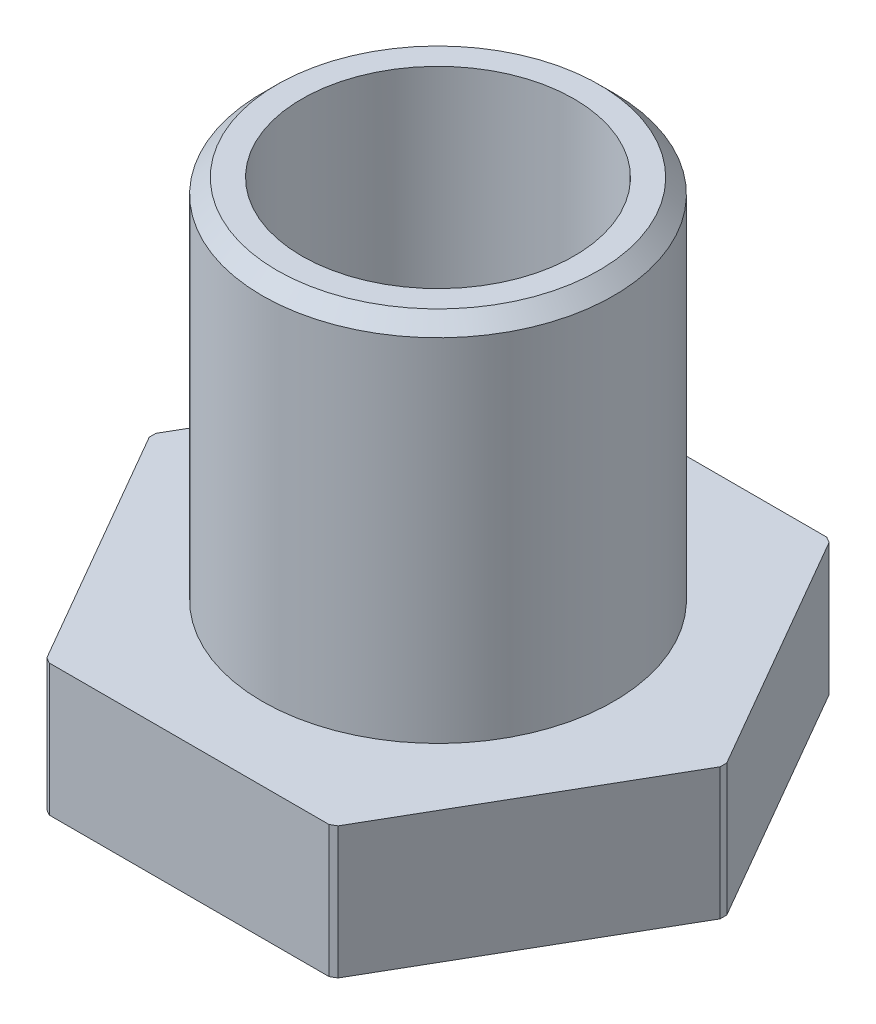
ISO-10303-21;
HEADER;
FILE_DESCRIPTION(('STEP AP214'),'2;1');
FILE_NAME('part.step','',(''),(''),'','','');
FILE_SCHEMA(('AUTOMOTIVE_DESIGN { 1 0 10303 214 1 1 1 1 }'));
ENDSEC;
DATA;
#1=APPLICATION_CONTEXT('core data for automotive mechanical design processes');
#2=APPLICATION_PROTOCOL_DEFINITION('international standard','automotive_design',2000,#1);
#3=PRODUCT_CONTEXT('',#1,'mechanical');
#4=PRODUCT('Part','Part','',(#3));
#5=PRODUCT_RELATED_PRODUCT_CATEGORY('part','',(#4));
#6=PRODUCT_DEFINITION_FORMATION('','',#4);
#7=PRODUCT_DEFINITION_CONTEXT('part definition',#1,'design');
#8=PRODUCT_DEFINITION('design','',#6,#7);
#9=PRODUCT_DEFINITION_SHAPE('','',#8);
#10=(LENGTH_UNIT() NAMED_UNIT(*) SI_UNIT(.MILLI.,.METRE.));
#11=(NAMED_UNIT(*) PLANE_ANGLE_UNIT() SI_UNIT($,.RADIAN.));
#12=(NAMED_UNIT(*) SI_UNIT($,.STERADIAN.) SOLID_ANGLE_UNIT());
#13=UNCERTAINTY_MEASURE_WITH_UNIT(LENGTH_MEASURE(1.E-05),#10,'distance_accuracy_value','');
#14=(GEOMETRIC_REPRESENTATION_CONTEXT(3) GLOBAL_UNCERTAINTY_ASSIGNED_CONTEXT((#13)) GLOBAL_UNIT_ASSIGNED_CONTEXT((#10,
#11,#12)) REPRESENTATION_CONTEXT('',''));
#15=CARTESIAN_POINT('',(0.,0.,0.));
#16=DIRECTION('',(0.,0.,1.));
#17=DIRECTION('',(1.,0.,0.));
#18=AXIS2_PLACEMENT_3D('',#15,#16,#17);
#19=CARTESIAN_POINT('',(9.81495457622364,0.,0.));
#20=DIRECTION('',(0.,1.,0.));
#21=DIRECTION('',(0.,0.,1.));
#22=AXIS2_PLACEMENT_3D('',#19,#20,#21);
#23=PLANE('',#22);
#24=CARTESIAN_POINT('',(0.,0.,0.));
#25=DIRECTION('',(0.,-1.,0.));
#26=DIRECTION('',(0.,0.,-1.));
#27=AXIS2_PLACEMENT_3D('',#24,#25,#26);
#28=CIRCLE('',#27,6.75);
#29=CARTESIAN_POINT('',(0.,0.,-6.75));
#30=VERTEX_POINT('',#29);
#31=EDGE_CURVE('E244',#30,#30,#28,.T.);
#32=ORIENTED_EDGE('',*,*,#31,.F.);
#33=EDGE_LOOP('',(#32));
#34=FACE_BOUND('',#33,.T.);
#35=CARTESIAN_POINT('',(0.,0.,0.));
#36=DIRECTION('',(0.,-1.,0.));
#37=DIRECTION('',(0.,0.,-1.));
#38=AXIS2_PLACEMENT_3D('',#35,#36,#37);
#39=CIRCLE('',#38,9.75);
#40=CARTESIAN_POINT('',(-4.97309428534989,0.,-8.38634802694357));
#41=VERTEX_POINT('',#40);
#42=CARTESIAN_POINT('',(-4.77624329363569,0.,-8.5));
#43=VERTEX_POINT('',#42);
#44=EDGE_CURVE('E59',#41,#43,#39,.T.);
#45=ORIENTED_EDGE('',*,*,#44,.T.);
#46=DIRECTION('',(-1.,0.,0.));
#47=VECTOR('',#46,1.);
#48=CARTESIAN_POINT('',(4.90747728811182,0.,-8.5));
#49=LINE('',#48,#47);
#50=CARTESIAN_POINT('',(4.77624329363569,0.,-8.5));
#51=VERTEX_POINT('',#50);
#52=EDGE_CURVE('E143',#51,#43,#49,.T.);
#53=ORIENTED_EDGE('',*,*,#52,.F.);
#54=CARTESIAN_POINT('',(0.,0.,0.));
#55=DIRECTION('',(0.,-1.,0.));
#56=DIRECTION('',(0.,0.,-1.));
#57=AXIS2_PLACEMENT_3D('',#54,#55,#56);
#58=CIRCLE('',#57,9.75);
#59=CARTESIAN_POINT('',(4.97309428534988,0.,-8.38634802694357));
#60=VERTEX_POINT('',#59);
#61=EDGE_CURVE('E67',#51,#60,#58,.T.);
#62=ORIENTED_EDGE('',*,*,#61,.T.);
#63=DIRECTION('',(-0.5,0.,-0.866025403784439));
#64=VECTOR('',#63,1.);
#65=CARTESIAN_POINT('',(9.81495457622364,0.,0.));
#66=LINE('',#65,#64);
#67=CARTESIAN_POINT('',(9.74933757898557,0.,-0.113651973056435));
#68=VERTEX_POINT('',#67);
#69=EDGE_CURVE('E148',#68,#60,#66,.T.);
#70=ORIENTED_EDGE('',*,*,#69,.F.);
#71=CARTESIAN_POINT('',(0.,0.,0.));
#72=DIRECTION('',(0.,-1.,0.));
#73=DIRECTION('',(0.,0.,-1.));
#74=AXIS2_PLACEMENT_3D('',#71,#72,#73);
#75=CIRCLE('',#74,9.75);
#76=CARTESIAN_POINT('',(9.74933757898558,0.,0.113651973056438));
#77=VERTEX_POINT('',#76);
#78=EDGE_CURVE('E187',#68,#77,#75,.T.);
#79=ORIENTED_EDGE('',*,*,#78,.T.);
#80=DIRECTION('',(0.5,0.,-0.866025403784439));
#81=VECTOR('',#80,1.);
#82=CARTESIAN_POINT('',(4.90747728811182,0.,8.50000000000001));
#83=LINE('',#82,#81);
#84=CARTESIAN_POINT('',(4.97309428534989,0.,8.38634802694356));
#85=VERTEX_POINT('',#84);
#86=EDGE_CURVE('E153',#85,#77,#83,.T.);
#87=ORIENTED_EDGE('',*,*,#86,.F.);
#88=CARTESIAN_POINT('',(0.,0.,0.));
#89=DIRECTION('',(0.,-1.,0.));
#90=DIRECTION('',(0.,0.,-1.));
#91=AXIS2_PLACEMENT_3D('',#88,#89,#90);
#92=CIRCLE('',#91,9.75);
#93=CARTESIAN_POINT('',(4.77624329363569,0.,8.5));
#94=VERTEX_POINT('',#93);
#95=EDGE_CURVE('E214',#85,#94,#92,.T.);
#96=ORIENTED_EDGE('',*,*,#95,.T.);
#97=DIRECTION('',(1.,0.,0.));
#98=VECTOR('',#97,1.);
#99=CARTESIAN_POINT('',(-4.90747728811182,0.,8.50000000000001));
#100=LINE('',#99,#98);
#101=CARTESIAN_POINT('',(-4.77624329363569,0.,8.50000000000001));
#102=VERTEX_POINT('',#101);
#103=EDGE_CURVE('E159',#102,#94,#100,.T.);
#104=ORIENTED_EDGE('',*,*,#103,.F.);
#105=CARTESIAN_POINT('',(0.,0.,0.));
#106=DIRECTION('',(0.,-1.,0.));
#107=DIRECTION('',(0.,0.,-1.));
#108=AXIS2_PLACEMENT_3D('',#105,#106,#107);
#109=CIRCLE('',#108,9.75);
#110=CARTESIAN_POINT('',(-4.97309428534988,0.,8.38634802694357));
#111=VERTEX_POINT('',#110);
#112=EDGE_CURVE('E230',#102,#111,#109,.T.);
#113=ORIENTED_EDGE('',*,*,#112,.T.);
#114=DIRECTION('',(0.5,0.,0.866025403784438));
#115=VECTOR('',#114,1.);
#116=CARTESIAN_POINT('',(-9.81495457622364,0.,0.));
#117=LINE('',#116,#115);
#118=CARTESIAN_POINT('',(-9.74933757898558,0.,0.113651973056427));
#119=VERTEX_POINT('',#118);
#120=EDGE_CURVE('E150',#119,#111,#117,.T.);
#121=ORIENTED_EDGE('',*,*,#120,.F.);
#122=CARTESIAN_POINT('',(0.,0.,0.));
#123=DIRECTION('',(0.,-1.,0.));
#124=DIRECTION('',(0.,0.,-1.));
#125=AXIS2_PLACEMENT_3D('',#122,#123,#124);
#126=CIRCLE('',#125,9.75);
#127=CARTESIAN_POINT('',(-9.74933757898558,0.,-0.113651973056427));
#128=VERTEX_POINT('',#127);
#129=EDGE_CURVE('E238',#119,#128,#126,.T.);
#130=ORIENTED_EDGE('',*,*,#129,.T.);
#131=DIRECTION('',(-0.5,0.,0.866025403784439));
#132=VECTOR('',#131,1.);
#133=CARTESIAN_POINT('',(-4.90747728811182,0.,-8.5));
#134=LINE('',#133,#132);
#135=EDGE_CURVE('E145',#41,#128,#134,.T.);
#136=ORIENTED_EDGE('',*,*,#135,.F.);
#137=EDGE_LOOP('',(#45,#53,#62,#70,#79,#87,#96,#104,#113,#121,#130,#136));
#138=FACE_BOUND('',#137,.T.);
#139=ADVANCED_FACE('F45',(#34,#138),#23,.F.);
#140=CARTESIAN_POINT('',(-20.3397298662751,4.5,0.));
#141=DIRECTION('',(0.,1.,0.));
#142=DIRECTION('',(0.,0.,1.));
#143=AXIS2_PLACEMENT_3D('',#140,#141,#142);
#144=PLANE('',#143);
#145=CARTESIAN_POINT('',(0.,4.5,0.));
#146=DIRECTION('',(0.,1.,0.));
#147=DIRECTION('',(0.,0.,1.));
#148=AXIS2_PLACEMENT_3D('',#145,#146,#147);
#149=CIRCLE('',#148,6.);
#150=CARTESIAN_POINT('',(0.,4.5,6.));
#151=VERTEX_POINT('',#150);
#152=EDGE_CURVE('E253',#151,#151,#149,.T.);
#153=ORIENTED_EDGE('',*,*,#152,.F.);
#154=EDGE_LOOP('',(#153));
#155=FACE_BOUND('',#154,.T.);
#156=DIRECTION('',(-1.,0.,0.));
#157=VECTOR('',#156,1.);
#158=CARTESIAN_POINT('',(-20.3397298662751,4.5,-8.5));
#159=LINE('',#158,#157);
#160=CARTESIAN_POINT('',(4.77624329363569,4.5,-8.5));
#161=VERTEX_POINT('',#160);
#162=CARTESIAN_POINT('',(-4.77624329363569,4.5,-8.5));
#163=VERTEX_POINT('',#162);
#164=EDGE_CURVE('E183',#161,#163,#159,.T.);
#165=ORIENTED_EDGE('',*,*,#164,.T.);
#166=CARTESIAN_POINT('',(0.,4.5,0.));
#167=DIRECTION('',(0.,1.,0.));
#168=DIRECTION('',(0.,0.,1.));
#169=AXIS2_PLACEMENT_3D('',#166,#167,#168);
#170=CIRCLE('',#169,9.75);
#171=CARTESIAN_POINT('',(-4.97309428534988,4.5,-8.38634802694357));
#172=VERTEX_POINT('',#171);
#173=EDGE_CURVE('E134',#163,#172,#170,.T.);
#174=ORIENTED_EDGE('',*,*,#173,.T.);
#175=DIRECTION('',(-0.5,0.,0.866025403784439));
#176=VECTOR('',#175,1.);
#177=CARTESIAN_POINT('',(-12.4461483987365,4.5,4.55736138515367));
#178=LINE('',#177,#176);
#179=CARTESIAN_POINT('',(-9.74933757898558,4.5,-0.113651973056427));
#180=VERTEX_POINT('',#179);
#181=EDGE_CURVE('E190',#172,#180,#178,.T.);
#182=ORIENTED_EDGE('',*,*,#181,.T.);
#183=CARTESIAN_POINT('',(0.,4.5,0.));
#184=DIRECTION('',(0.,1.,0.));
#185=DIRECTION('',(0.,0.,1.));
#186=AXIS2_PLACEMENT_3D('',#183,#184,#185);
#187=CIRCLE('',#186,9.75);
#188=CARTESIAN_POINT('',(-9.74933757898558,4.5,0.113651973056426));
#189=VERTEX_POINT('',#188);
#190=EDGE_CURVE('E168',#180,#189,#187,.T.);
#191=ORIENTED_EDGE('',*,*,#190,.T.);
#192=DIRECTION('',(0.5,0.,0.866025403784439));
#193=VECTOR('',#192,1.);
#194=CARTESIAN_POINT('',(-12.4461483987365,4.5,-4.55736138515367));
#195=LINE('',#194,#193);
#196=CARTESIAN_POINT('',(-4.97309428534988,4.5,8.38634802694357));
#197=VERTEX_POINT('',#196);
#198=EDGE_CURVE('E192',#189,#197,#195,.T.);
#199=ORIENTED_EDGE('',*,*,#198,.T.);
#200=CARTESIAN_POINT('',(0.,4.5,0.));
#201=DIRECTION('',(0.,1.,0.));
#202=DIRECTION('',(0.,0.,1.));
#203=AXIS2_PLACEMENT_3D('',#200,#201,#202);
#204=CIRCLE('',#203,9.75);
#205=CARTESIAN_POINT('',(-4.77624329363569,4.5,8.5));
#206=VERTEX_POINT('',#205);
#207=EDGE_CURVE('E235',#197,#206,#204,.T.);
#208=ORIENTED_EDGE('',*,*,#207,.T.);
#209=DIRECTION('',(1.,0.,0.));
#210=VECTOR('',#209,1.);
#211=CARTESIAN_POINT('',(-20.3397298662751,4.5,8.5));
#212=LINE('',#211,#210);
#213=CARTESIAN_POINT('',(4.77624329363569,4.5,8.5));
#214=VERTEX_POINT('',#213);
#215=EDGE_CURVE('E258',#206,#214,#212,.T.);
#216=ORIENTED_EDGE('',*,*,#215,.T.);
#217=CARTESIAN_POINT('',(0.,4.5,0.));
#218=DIRECTION('',(0.,1.,0.));
#219=DIRECTION('',(0.,0.,1.));
#220=AXIS2_PLACEMENT_3D('',#217,#218,#219);
#221=CIRCLE('',#220,9.75);
#222=CARTESIAN_POINT('',(4.9730942853499,4.5,8.38634802694356));
#223=VERTEX_POINT('',#222);
#224=EDGE_CURVE('E227',#214,#223,#221,.T.);
#225=ORIENTED_EDGE('',*,*,#224,.T.);
#226=DIRECTION('',(0.5,0.,-0.866025403784439));
#227=VECTOR('',#226,1.);
#228=CARTESIAN_POINT('',(2.27628346559896,4.5,13.0573613851537));
#229=LINE('',#228,#227);
#230=CARTESIAN_POINT('',(9.74933757898558,4.5,0.113651973056438));
#231=VERTEX_POINT('',#230);
#232=EDGE_CURVE('E194',#223,#231,#229,.T.);
#233=ORIENTED_EDGE('',*,*,#232,.T.);
#234=CARTESIAN_POINT('',(0.,4.5,0.));
#235=DIRECTION('',(0.,1.,0.));
#236=DIRECTION('',(0.,0.,1.));
#237=AXIS2_PLACEMENT_3D('',#234,#235,#236);
#238=CIRCLE('',#237,9.75);
#239=CARTESIAN_POINT('',(9.74933757898558,4.5,-0.113651973056435));
#240=VERTEX_POINT('',#239);
#241=EDGE_CURVE('E219',#231,#240,#238,.T.);
#242=ORIENTED_EDGE('',*,*,#241,.T.);
#243=DIRECTION('',(-0.5,0.,-0.866025403784439));
#244=VECTOR('',#243,1.);
#245=CARTESIAN_POINT('',(2.27628346559894,4.5,-13.0573613851537));
#246=LINE('',#245,#244);
#247=CARTESIAN_POINT('',(4.97309428534988,4.5,-8.38634802694357));
#248=VERTEX_POINT('',#247);
#249=EDGE_CURVE('E186',#240,#248,#246,.T.);
#250=ORIENTED_EDGE('',*,*,#249,.T.);
#251=CARTESIAN_POINT('',(0.,4.5,0.));
#252=DIRECTION('',(0.,1.,0.));
#253=DIRECTION('',(0.,0.,1.));
#254=AXIS2_PLACEMENT_3D('',#251,#252,#253);
#255=CIRCLE('',#254,9.75);
#256=EDGE_CURVE('E178',#248,#161,#255,.T.);
#257=ORIENTED_EDGE('',*,*,#256,.T.);
#258=EDGE_LOOP('',(#165,#174,#182,#191,#199,#208,#216,#225,#233,#242,#250,#257));
#259=FACE_BOUND('',#258,.T.);
#260=ADVANCED_FACE('F182',(#155,#259),#144,.T.);
#261=CARTESIAN_POINT('',(4.90747728811182,17.,-8.5));
#262=DIRECTION('',(0.,0.,1.));
#263=DIRECTION('',(1.,0.,0.));
#264=AXIS2_PLACEMENT_3D('',#261,#262,#263);
#265=PLANE('',#264);
#266=DIRECTION('',(0.,-1.,0.));
#267=VECTOR('',#266,1.);
#268=CARTESIAN_POINT('',(-4.77624329363569,17.,-8.5));
#269=LINE('',#268,#267);
#270=EDGE_CURVE('E131',#163,#43,#269,.T.);
#271=ORIENTED_EDGE('',*,*,#270,.F.);
#272=ORIENTED_EDGE('',*,*,#164,.F.);
#273=DIRECTION('',(0.,-1.,0.));
#274=VECTOR('',#273,1.);
#275=CARTESIAN_POINT('',(4.77624329363569,17.,-8.5));
#276=LINE('',#275,#274);
#277=EDGE_CURVE('E53',#51,#161,#276,.F.);
#278=ORIENTED_EDGE('',*,*,#277,.F.);
#279=ORIENTED_EDGE('',*,*,#52,.T.);
#280=EDGE_LOOP('',(#271,#272,#278,#279));
#281=FACE_BOUND('',#280,.T.);
#282=ADVANCED_FACE('F147',(#281),#265,.F.);
#283=CARTESIAN_POINT('',(-4.90747728811182,17.,-8.5));
#284=DIRECTION('',(0.866025403784439,0.,0.5));
#285=DIRECTION('',(0.5,0.,-0.866025403784439));
#286=AXIS2_PLACEMENT_3D('',#283,#284,#285);
#287=PLANE('',#286);
#288=DIRECTION('',(0.,-1.,0.));
#289=VECTOR('',#288,1.);
#290=CARTESIAN_POINT('',(-4.97309428534989,17.,-8.38634802694357));
#291=LINE('',#290,#289);
#292=EDGE_CURVE('E13',#41,#172,#291,.F.);
#293=ORIENTED_EDGE('',*,*,#292,.F.);
#294=ORIENTED_EDGE('',*,*,#135,.T.);
#295=DIRECTION('',(0.,-1.,0.));
#296=VECTOR('',#295,1.);
#297=CARTESIAN_POINT('',(-9.74933757898558,17.,-0.113651973056427));
#298=LINE('',#297,#296);
#299=EDGE_CURVE('E241',#180,#128,#298,.T.);
#300=ORIENTED_EDGE('',*,*,#299,.F.);
#301=ORIENTED_EDGE('',*,*,#181,.F.);
#302=EDGE_LOOP('',(#293,#294,#300,#301));
#303=FACE_BOUND('',#302,.T.);
#304=ADVANCED_FACE('F279',(#303),#287,.F.);
#305=CARTESIAN_POINT('',(9.81495457622364,17.,0.));
#306=DIRECTION('',(-0.866025403784439,0.,0.5));
#307=DIRECTION('',(0.5,0.,0.866025403784439));
#308=AXIS2_PLACEMENT_3D('',#305,#306,#307);
#309=PLANE('',#308);
#310=DIRECTION('',(0.,-1.,0.));
#311=VECTOR('',#310,1.);
#312=CARTESIAN_POINT('',(4.97309428534988,17.,-8.38634802694357));
#313=LINE('',#312,#311);
#314=EDGE_CURVE('E188',#248,#60,#313,.T.);
#315=ORIENTED_EDGE('',*,*,#314,.F.);
#316=ORIENTED_EDGE('',*,*,#249,.F.);
#317=DIRECTION('',(0.,-1.,0.));
#318=VECTOR('',#317,1.);
#319=CARTESIAN_POINT('',(9.74933757898558,17.,-0.113651973056431));
#320=LINE('',#319,#318);
#321=EDGE_CURVE('E175',#68,#240,#320,.F.);
#322=ORIENTED_EDGE('',*,*,#321,.F.);
#323=ORIENTED_EDGE('',*,*,#69,.T.);
#324=EDGE_LOOP('',(#315,#316,#322,#323));
#325=FACE_BOUND('',#324,.T.);
#326=ADVANCED_FACE('F281',(#325),#309,.F.);
#327=CARTESIAN_POINT('',(4.90747728811182,17.,8.50000000000001));
#328=DIRECTION('',(-0.866025403784439,0.,-0.5));
#329=DIRECTION('',(-0.5,0.,0.866025403784439));
#330=AXIS2_PLACEMENT_3D('',#327,#328,#329);
#331=PLANE('',#330);
#332=DIRECTION('',(0.,-1.,0.));
#333=VECTOR('',#332,1.);
#334=CARTESIAN_POINT('',(9.74933757898558,17.,0.113651973056438));
#335=LINE('',#334,#333);
#336=EDGE_CURVE('E209',#231,#77,#335,.T.);
#337=ORIENTED_EDGE('',*,*,#336,.F.);
#338=ORIENTED_EDGE('',*,*,#232,.F.);
#339=DIRECTION('',(0.,-1.,0.));
#340=VECTOR('',#339,1.);
#341=CARTESIAN_POINT('',(4.97309428534988,17.,8.38634802694357));
#342=LINE('',#341,#340);
#343=EDGE_CURVE('E173',#85,#223,#342,.F.);
#344=ORIENTED_EDGE('',*,*,#343,.F.);
#345=ORIENTED_EDGE('',*,*,#86,.T.);
#346=EDGE_LOOP('',(#337,#338,#344,#345));
#347=FACE_BOUND('',#346,.T.);
#348=ADVANCED_FACE('F207',(#347),#331,.F.);
#349=CARTESIAN_POINT('',(-4.90747728811182,17.,8.50000000000001));
#350=DIRECTION('',(0.,0.,-1.));
#351=DIRECTION('',(-1.,0.,0.));
#352=AXIS2_PLACEMENT_3D('',#349,#350,#351);
#353=PLANE('',#352);
#354=DIRECTION('',(0.,-1.,0.));
#355=VECTOR('',#354,1.);
#356=CARTESIAN_POINT('',(4.77624329363569,17.,8.5));
#357=LINE('',#356,#355);
#358=EDGE_CURVE('E225',#214,#94,#357,.T.);
#359=ORIENTED_EDGE('',*,*,#358,.F.);
#360=ORIENTED_EDGE('',*,*,#215,.F.);
#361=DIRECTION('',(0.,-1.,0.));
#362=VECTOR('',#361,1.);
#363=CARTESIAN_POINT('',(-4.77624329363569,17.,8.50000000000001));
#364=LINE('',#363,#362);
#365=EDGE_CURVE('E171',#102,#206,#364,.F.);
#366=ORIENTED_EDGE('',*,*,#365,.F.);
#367=ORIENTED_EDGE('',*,*,#103,.T.);
#368=EDGE_LOOP('',(#359,#360,#366,#367));
#369=FACE_BOUND('',#368,.T.);
#370=ADVANCED_FACE('F265',(#369),#353,.F.);
#371=CARTESIAN_POINT('',(-9.81495457622364,17.,0.));
#372=DIRECTION('',(0.866025403784439,0.,-0.5));
#373=DIRECTION('',(-0.5,0.,-0.866025403784439));
#374=AXIS2_PLACEMENT_3D('',#371,#372,#373);
#375=PLANE('',#374);
#376=DIRECTION('',(0.,-1.,0.));
#377=VECTOR('',#376,1.);
#378=CARTESIAN_POINT('',(-4.97309428534988,17.,8.38634802694357));
#379=LINE('',#378,#377);
#380=EDGE_CURVE('E233',#197,#111,#379,.T.);
#381=ORIENTED_EDGE('',*,*,#380,.F.);
#382=ORIENTED_EDGE('',*,*,#198,.F.);
#383=DIRECTION('',(0.,-1.,0.));
#384=VECTOR('',#383,1.);
#385=CARTESIAN_POINT('',(-9.74933757898558,17.,0.113651973056427));
#386=LINE('',#385,#384);
#387=EDGE_CURVE('E240',#189,#119,#386,.T.);
#388=ORIENTED_EDGE('',*,*,#387,.T.);
#389=ORIENTED_EDGE('',*,*,#120,.T.);
#390=EDGE_LOOP('',(#381,#382,#388,#389));
#391=FACE_BOUND('',#390,.T.);
#392=ADVANCED_FACE('F271',(#391),#375,.F.);
#393=CARTESIAN_POINT('',(0.,17.,0.));
#394=DIRECTION('',(0.,-1.,0.));
#395=DIRECTION('',(0.,0.,-1.));
#396=AXIS2_PLACEMENT_3D('',#393,#394,#395);
#397=CYLINDRICAL_SURFACE('',#396,4.65);
#398=CARTESIAN_POINT('',(0.,17.,0.));
#399=DIRECTION('',(0.,1.,0.));
#400=DIRECTION('',(0.,0.,1.));
#401=AXIS2_PLACEMENT_3D('',#398,#399,#400);
#402=CIRCLE('',#401,4.65);
#403=CARTESIAN_POINT('',(0.,17.,4.65));
#404=VERTEX_POINT('',#403);
#405=EDGE_CURVE('E200',#404,#404,#402,.T.);
#406=ORIENTED_EDGE('',*,*,#405,.T.);
#407=EDGE_LOOP('',(#406));
#408=FACE_BOUND('',#407,.T.);
#409=CARTESIAN_POINT('',(0.,2.2,0.));
#410=DIRECTION('',(0.,-1.,0.));
#411=DIRECTION('',(0.,0.,-1.));
#412=AXIS2_PLACEMENT_3D('',#409,#410,#411);
#413=CIRCLE('',#412,4.65);
#414=CARTESIAN_POINT('',(0.,2.2,-4.65));
#415=VERTEX_POINT('',#414);
#416=EDGE_CURVE('E247',#415,#415,#413,.F.);
#417=ORIENTED_EDGE('',*,*,#416,.F.);
#418=EDGE_LOOP('',(#417));
#419=FACE_BOUND('',#418,.T.);
#420=ADVANCED_FACE('F306',(#408,#419),#397,.F.);
#421=CARTESIAN_POINT('',(9.81495457622364,17.,0.));
#422=DIRECTION('',(0.,1.,0.));
#423=DIRECTION('',(0.,0.,1.));
#424=AXIS2_PLACEMENT_3D('',#421,#422,#423);
#425=PLANE('',#424);
#426=CARTESIAN_POINT('',(0.,17.,0.));
#427=DIRECTION('',(0.,1.,0.));
#428=DIRECTION('',(0.,0.,1.));
#429=AXIS2_PLACEMENT_3D('',#426,#427,#428);
#430=CIRCLE('',#429,5.5);
#431=CARTESIAN_POINT('',(0.,17.,5.5));
#432=VERTEX_POINT('',#431);
#433=EDGE_CURVE('E162',#432,#432,#430,.T.);
#434=ORIENTED_EDGE('',*,*,#433,.T.);
#435=EDGE_LOOP('',(#434));
#436=FACE_BOUND('',#435,.T.);
#437=ORIENTED_EDGE('',*,*,#405,.F.);
#438=EDGE_LOOP('',(#437));
#439=FACE_BOUND('',#438,.T.);
#440=ADVANCED_FACE('F302',(#436,#439),#425,.T.);
#441=CARTESIAN_POINT('',(0.,4.5,0.));
#442=DIRECTION('',(0.,1.,0.));
#443=DIRECTION('',(0.,0.,1.));
#444=AXIS2_PLACEMENT_3D('',#441,#442,#443);
#445=CYLINDRICAL_SURFACE('',#444,6.);
#446=CARTESIAN_POINT('',(0.,16.5,0.));
#447=DIRECTION('',(0.,1.,0.));
#448=DIRECTION('',(0.,0.,1.));
#449=AXIS2_PLACEMENT_3D('',#446,#447,#448);
#450=CIRCLE('',#449,6.);
#451=CARTESIAN_POINT('',(0.,16.5,6.));
#452=VERTEX_POINT('',#451);
#453=EDGE_CURVE('E165',#452,#452,#450,.F.);
#454=ORIENTED_EDGE('',*,*,#453,.T.);
#455=EDGE_LOOP('',(#454));
#456=FACE_BOUND('',#455,.T.);
#457=ORIENTED_EDGE('',*,*,#152,.T.);
#458=EDGE_LOOP('',(#457));
#459=FACE_BOUND('',#458,.T.);
#460=ADVANCED_FACE('F314',(#456,#459),#445,.T.);
#461=CARTESIAN_POINT('',(0.,2.2,0.));
#462=DIRECTION('',(0.,-1.,0.));
#463=DIRECTION('',(0.,0.,-1.));
#464=AXIS2_PLACEMENT_3D('',#461,#462,#463);
#465=CYLINDRICAL_SURFACE('',#464,6.75);
#466=CARTESIAN_POINT('',(0.,2.2,0.));
#467=DIRECTION('',(0.,-1.,0.));
#468=DIRECTION('',(0.,0.,-1.));
#469=AXIS2_PLACEMENT_3D('',#466,#467,#468);
#470=CIRCLE('',#469,6.75);
#471=CARTESIAN_POINT('',(0.,2.2,-6.75));
#472=VERTEX_POINT('',#471);
#473=EDGE_CURVE('E250',#472,#472,#470,.T.);
#474=ORIENTED_EDGE('',*,*,#473,.F.);
#475=EDGE_LOOP('',(#474));
#476=FACE_BOUND('',#475,.T.);
#477=ORIENTED_EDGE('',*,*,#31,.T.);
#478=EDGE_LOOP('',(#477));
#479=FACE_BOUND('',#478,.T.);
#480=ADVANCED_FACE('F319',(#476,#479),#465,.F.);
#481=CARTESIAN_POINT('',(0.,2.2,-20.3397298662751));
#482=DIRECTION('',(0.,-1.,0.));
#483=DIRECTION('',(0.,0.,-1.));
#484=AXIS2_PLACEMENT_3D('',#481,#482,#483);
#485=PLANE('',#484);
#486=ORIENTED_EDGE('',*,*,#416,.T.);
#487=EDGE_LOOP('',(#486));
#488=FACE_BOUND('',#487,.T.);
#489=ORIENTED_EDGE('',*,*,#473,.T.);
#490=EDGE_LOOP('',(#489));
#491=FACE_BOUND('',#490,.T.);
#492=ADVANCED_FACE('F324',(#488,#491),#485,.T.);
#493=CARTESIAN_POINT('',(0.,17.,0.));
#494=DIRECTION('',(0.,-1.,0.));
#495=DIRECTION('',(0.,0.,-1.));
#496=AXIS2_PLACEMENT_3D('',#493,#494,#495);
#497=CONICAL_SURFACE('',#496,5.5,0.785398163397444);
#498=ORIENTED_EDGE('',*,*,#453,.F.);
#499=EDGE_LOOP('',(#498));
#500=FACE_BOUND('',#499,.T.);
#501=ORIENTED_EDGE('',*,*,#433,.F.);
#502=EDGE_LOOP('',(#501));
#503=FACE_BOUND('',#502,.T.);
#504=ADVANCED_FACE('F47',(#500,#503),#497,.T.);
#505=CARTESIAN_POINT('',(0.,17.,0.));
#506=DIRECTION('',(0.,-1.,0.));
#507=DIRECTION('',(0.,0.,-1.));
#508=AXIS2_PLACEMENT_3D('',#505,#506,#507);
#509=CYLINDRICAL_SURFACE('',#508,9.75);
#510=ORIENTED_EDGE('',*,*,#299,.T.);
#511=ORIENTED_EDGE('',*,*,#129,.F.);
#512=ORIENTED_EDGE('',*,*,#387,.F.);
#513=ORIENTED_EDGE('',*,*,#190,.F.);
#514=EDGE_LOOP('',(#510,#511,#512,#513));
#515=FACE_BOUND('',#514,.T.);
#516=ADVANCED_FACE('F275',(#515),#509,.T.);
#517=CARTESIAN_POINT('',(0.,17.,0.));
#518=DIRECTION('',(0.,-1.,0.));
#519=DIRECTION('',(0.,0.,-1.));
#520=AXIS2_PLACEMENT_3D('',#517,#518,#519);
#521=CYLINDRICAL_SURFACE('',#520,9.75);
#522=ORIENTED_EDGE('',*,*,#380,.T.);
#523=ORIENTED_EDGE('',*,*,#112,.F.);
#524=ORIENTED_EDGE('',*,*,#365,.T.);
#525=ORIENTED_EDGE('',*,*,#207,.F.);
#526=EDGE_LOOP('',(#522,#523,#524,#525));
#527=FACE_BOUND('',#526,.T.);
#528=ADVANCED_FACE('F331',(#527),#521,.T.);
#529=CARTESIAN_POINT('',(0.,17.,0.));
#530=DIRECTION('',(0.,-1.,0.));
#531=DIRECTION('',(0.,0.,-1.));
#532=AXIS2_PLACEMENT_3D('',#529,#530,#531);
#533=CYLINDRICAL_SURFACE('',#532,9.75);
#534=ORIENTED_EDGE('',*,*,#358,.T.);
#535=ORIENTED_EDGE('',*,*,#95,.F.);
#536=ORIENTED_EDGE('',*,*,#343,.T.);
#537=ORIENTED_EDGE('',*,*,#224,.F.);
#538=EDGE_LOOP('',(#534,#535,#536,#537));
#539=FACE_BOUND('',#538,.T.);
#540=ADVANCED_FACE('F263',(#539),#533,.T.);
#541=CARTESIAN_POINT('',(0.,17.,0.));
#542=DIRECTION('',(0.,-1.,0.));
#543=DIRECTION('',(0.,0.,-1.));
#544=AXIS2_PLACEMENT_3D('',#541,#542,#543);
#545=CYLINDRICAL_SURFACE('',#544,9.75);
#546=ORIENTED_EDGE('',*,*,#336,.T.);
#547=ORIENTED_EDGE('',*,*,#78,.F.);
#548=ORIENTED_EDGE('',*,*,#321,.T.);
#549=ORIENTED_EDGE('',*,*,#241,.F.);
#550=EDGE_LOOP('',(#546,#547,#548,#549));
#551=FACE_BOUND('',#550,.T.);
#552=ADVANCED_FACE('F336',(#551),#545,.T.);
#553=CARTESIAN_POINT('',(0.,17.,0.));
#554=DIRECTION('',(0.,-1.,0.));
#555=DIRECTION('',(0.,0.,-1.));
#556=AXIS2_PLACEMENT_3D('',#553,#554,#555);
#557=CYLINDRICAL_SURFACE('',#556,9.75);
#558=ORIENTED_EDGE('',*,*,#314,.T.);
#559=ORIENTED_EDGE('',*,*,#61,.F.);
#560=ORIENTED_EDGE('',*,*,#277,.T.);
#561=ORIENTED_EDGE('',*,*,#256,.F.);
#562=EDGE_LOOP('',(#558,#559,#560,#561));
#563=FACE_BOUND('',#562,.T.);
#564=ADVANCED_FACE('F177',(#563),#557,.T.);
#565=CARTESIAN_POINT('',(0.,17.,0.));
#566=DIRECTION('',(0.,-1.,0.));
#567=DIRECTION('',(0.,0.,-1.));
#568=AXIS2_PLACEMENT_3D('',#565,#566,#567);
#569=CYLINDRICAL_SURFACE('',#568,9.75);
#570=ORIENTED_EDGE('',*,*,#270,.T.);
#571=ORIENTED_EDGE('',*,*,#44,.F.);
#572=ORIENTED_EDGE('',*,*,#292,.T.);
#573=ORIENTED_EDGE('',*,*,#173,.F.);
#574=EDGE_LOOP('',(#570,#571,#572,#573));
#575=FACE_BOUND('',#574,.T.);
#576=ADVANCED_FACE('F132',(#575),#569,.T.);
#577=CLOSED_SHELL('',(#139,#260,#282,#304,#326,#348,#370,#392,#420,#440,#460,#480,#492,#504,
#516,#528,#540,#552,#564,#576));
#578=MANIFOLD_SOLID_BREP('B2',#577);
#579=ADVANCED_BREP_SHAPE_REPRESENTATION('',(#18,#578),#14);
#580=SHAPE_DEFINITION_REPRESENTATION(#9,#579);
ENDSEC;
END-ISO-10303-21;
